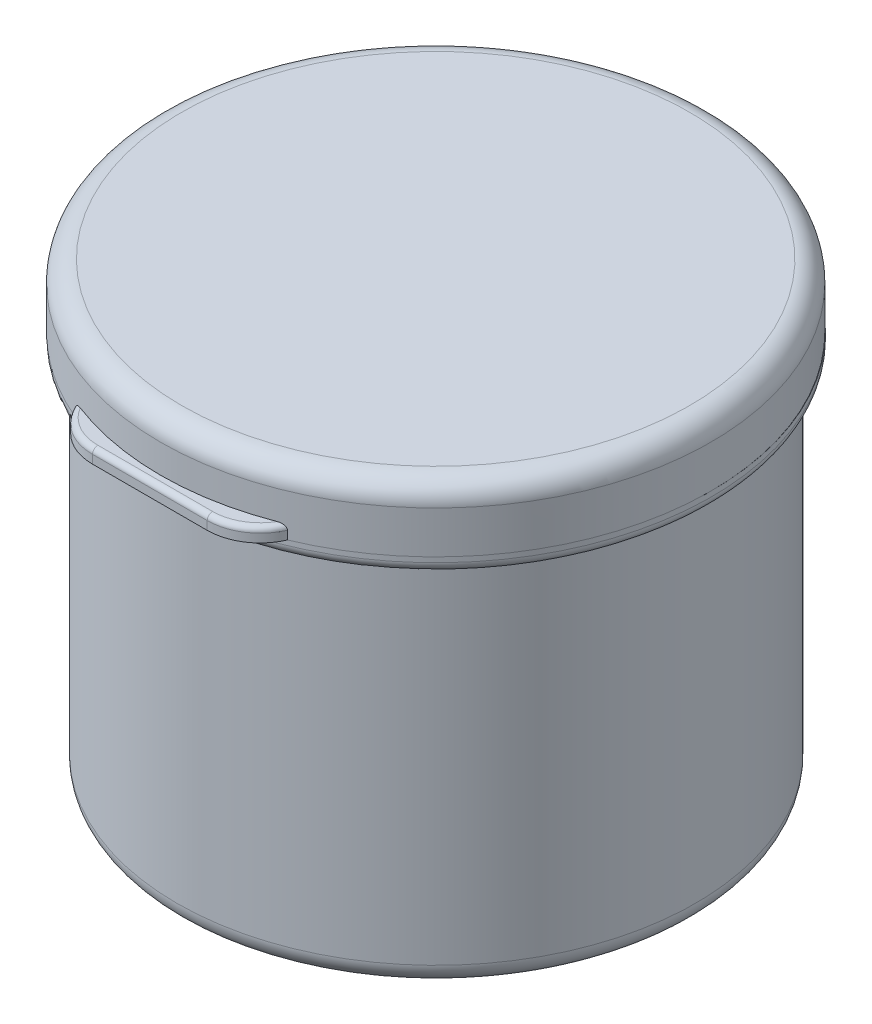
ISO-10303-21;
HEADER;
FILE_DESCRIPTION(('STEP AP214'),'2;1');
FILE_NAME('part.step','',(''),(''),'','','');
FILE_SCHEMA(('AUTOMOTIVE_DESIGN { 1 0 10303 214 1 1 1 1 }'));
ENDSEC;
DATA;
#1=APPLICATION_CONTEXT('core data for automotive mechanical design processes');
#2=APPLICATION_PROTOCOL_DEFINITION('international standard','automotive_design',2000,#1);
#3=PRODUCT_CONTEXT('',#1,'mechanical');
#4=PRODUCT('Part','Part','',(#3));
#5=PRODUCT_RELATED_PRODUCT_CATEGORY('part','',(#4));
#6=PRODUCT_DEFINITION_FORMATION('','',#4);
#7=PRODUCT_DEFINITION_CONTEXT('part definition',#1,'design');
#8=PRODUCT_DEFINITION('design','',#6,#7);
#9=PRODUCT_DEFINITION_SHAPE('','',#8);
#10=(LENGTH_UNIT() NAMED_UNIT(*) SI_UNIT(.MILLI.,.METRE.));
#11=(NAMED_UNIT(*) PLANE_ANGLE_UNIT() SI_UNIT($,.RADIAN.));
#12=(NAMED_UNIT(*) SI_UNIT($,.STERADIAN.) SOLID_ANGLE_UNIT());
#13=UNCERTAINTY_MEASURE_WITH_UNIT(LENGTH_MEASURE(1.E-05),#10,'distance_accuracy_value','');
#14=(GEOMETRIC_REPRESENTATION_CONTEXT(3) GLOBAL_UNCERTAINTY_ASSIGNED_CONTEXT((#13)) GLOBAL_UNIT_ASSIGNED_CONTEXT((#10,
#11,#12)) REPRESENTATION_CONTEXT('',''));
#15=CARTESIAN_POINT('',(0.,0.,0.));
#16=DIRECTION('',(0.,0.,1.));
#17=DIRECTION('',(1.,0.,0.));
#18=AXIS2_PLACEMENT_3D('',#15,#16,#17);
#19=CARTESIAN_POINT('',(0.,36.5,0.));
#20=DIRECTION('',(0.,1.,0.));
#21=DIRECTION('',(0.,0.,1.));
#22=AXIS2_PLACEMENT_3D('',#19,#20,#21);
#23=PLANE('',#22);
#24=CARTESIAN_POINT('',(0.,36.5,0.));
#25=DIRECTION('',(0.,1.,0.));
#26=DIRECTION('',(0.,0.,1.));
#27=AXIS2_PLACEMENT_3D('',#24,#25,#26);
#28=CIRCLE('',#27,26.);
#29=CARTESIAN_POINT('',(0.,36.5,26.));
#30=VERTEX_POINT('',#29);
#31=EDGE_CURVE('P0_E53',#30,#30,#28,.T.);
#32=ORIENTED_EDGE('',*,*,#31,.T.);
#33=EDGE_LOOP('',(#32));
#34=FACE_BOUND('',#33,.T.);
#35=CARTESIAN_POINT('',(0.,36.5,0.));
#36=DIRECTION('',(0.,1.,0.));
#37=DIRECTION('',(0.,0.,1.));
#38=AXIS2_PLACEMENT_3D('',#35,#36,#37);
#39=CIRCLE('',#38,24.5);
#40=CARTESIAN_POINT('',(0.,36.5,24.5));
#41=VERTEX_POINT('',#40);
#42=EDGE_CURVE('P0_E57',#41,#41,#39,.T.);
#43=ORIENTED_EDGE('',*,*,#42,.F.);
#44=EDGE_LOOP('',(#43));
#45=FACE_BOUND('',#44,.T.);
#46=ADVANCED_FACE('P0_F17',(#34,#45),#23,.T.);
#47=CARTESIAN_POINT('',(0.,35.,0.));
#48=DIRECTION('',(0.,1.,0.));
#49=DIRECTION('',(0.,0.,1.));
#50=AXIS2_PLACEMENT_3D('',#47,#48,#49);
#51=CYLINDRICAL_SURFACE('',#50,26.);
#52=CARTESIAN_POINT('',(0.,36.,0.));
#53=DIRECTION('',(0.,1.,0.));
#54=DIRECTION('',(0.,0.,1.));
#55=AXIS2_PLACEMENT_3D('',#52,#53,#54);
#56=CIRCLE('',#55,26.);
#57=CARTESIAN_POINT('',(0.,36.,26.));
#58=VERTEX_POINT('',#57);
#59=EDGE_CURVE('P0_E40',#58,#58,#56,.T.);
#60=ORIENTED_EDGE('',*,*,#59,.T.);
#61=EDGE_LOOP('',(#60));
#62=FACE_BOUND('',#61,.T.);
#63=ORIENTED_EDGE('',*,*,#31,.F.);
#64=EDGE_LOOP('',(#63));
#65=FACE_BOUND('',#64,.T.);
#66=ADVANCED_FACE('P0_F92',(#62,#65),#51,.T.);
#67=CARTESIAN_POINT('',(0.,35.,0.));
#68=DIRECTION('',(0.,1.,0.));
#69=DIRECTION('',(0.,0.,1.));
#70=AXIS2_PLACEMENT_3D('',#67,#68,#69);
#71=PLANE('',#70);
#72=CARTESIAN_POINT('',(0.,35.,0.));
#73=DIRECTION('',(0.,1.,0.));
#74=DIRECTION('',(0.,0.,1.));
#75=AXIS2_PLACEMENT_3D('',#72,#73,#74);
#76=CIRCLE('',#75,25.);
#77=CARTESIAN_POINT('',(0.,35.,25.));
#78=VERTEX_POINT('',#77);
#79=EDGE_CURVE('P0_E37',#78,#78,#76,.F.);
#80=ORIENTED_EDGE('',*,*,#79,.T.);
#81=EDGE_LOOP('',(#80));
#82=FACE_BOUND('',#81,.T.);
#83=CARTESIAN_POINT('',(0.,35.,0.));
#84=DIRECTION('',(0.,1.,0.));
#85=DIRECTION('',(0.,0.,1.));
#86=AXIS2_PLACEMENT_3D('',#83,#84,#85);
#87=CIRCLE('',#86,24.5);
#88=CARTESIAN_POINT('',(0.,35.,24.5));
#89=VERTEX_POINT('',#88);
#90=EDGE_CURVE('P0_E50',#89,#89,#87,.T.);
#91=ORIENTED_EDGE('',*,*,#90,.T.);
#92=EDGE_LOOP('',(#91));
#93=FACE_BOUND('',#92,.T.);
#94=ADVANCED_FACE('P0_F98',(#82,#93),#71,.F.);
#95=CARTESIAN_POINT('',(0.,0.,0.));
#96=DIRECTION('',(0.,1.,0.));
#97=DIRECTION('',(0.,0.,1.));
#98=AXIS2_PLACEMENT_3D('',#95,#96,#97);
#99=PLANE('',#98);
#100=CARTESIAN_POINT('',(0.,0.,0.));
#101=DIRECTION('',(0.,1.,0.));
#102=DIRECTION('',(0.,0.,1.));
#103=AXIS2_PLACEMENT_3D('',#100,#101,#102);
#104=CIRCLE('',#103,22.5);
#105=CARTESIAN_POINT('',(0.,0.,22.5));
#106=VERTEX_POINT('',#105);
#107=EDGE_CURVE('P0_E28',#106,#106,#104,.F.);
#108=ORIENTED_EDGE('',*,*,#107,.T.);
#109=EDGE_LOOP('',(#108));
#110=FACE_BOUND('',#109,.T.);
#111=ADVANCED_FACE('P0_F105',(#110),#99,.F.);
#112=CARTESIAN_POINT('',(0.,36.5,0.));
#113=DIRECTION('',(0.,-1.,0.));
#114=DIRECTION('',(0.,0.,-1.));
#115=AXIS2_PLACEMENT_3D('',#112,#113,#114);
#116=CYLINDRICAL_SURFACE('',#115,24.5);
#117=CARTESIAN_POINT('',(0.,2.,0.));
#118=DIRECTION('',(0.,1.,0.));
#119=DIRECTION('',(0.,0.,1.));
#120=AXIS2_PLACEMENT_3D('',#117,#118,#119);
#121=CIRCLE('',#120,24.5);
#122=CARTESIAN_POINT('',(0.,2.,24.5));
#123=VERTEX_POINT('',#122);
#124=EDGE_CURVE('P0_E32',#123,#123,#121,.T.);
#125=ORIENTED_EDGE('',*,*,#124,.T.);
#126=EDGE_LOOP('',(#125));
#127=FACE_BOUND('',#126,.T.);
#128=ORIENTED_EDGE('',*,*,#90,.F.);
#129=EDGE_LOOP('',(#128));
#130=FACE_BOUND('',#129,.T.);
#131=ADVANCED_FACE('P0_F108',(#127,#130),#116,.T.);
#132=CARTESIAN_POINT('',(0.,39.4,0.));
#133=DIRECTION('',(0.,-1.,0.));
#134=DIRECTION('',(0.,0.,-1.));
#135=AXIS2_PLACEMENT_3D('',#132,#133,#134);
#136=CYLINDRICAL_SURFACE('',#135,24.5);
#137=CARTESIAN_POINT('',(0.,39.4,0.));
#138=DIRECTION('',(0.,1.,0.));
#139=DIRECTION('',(0.,0.,1.));
#140=AXIS2_PLACEMENT_3D('',#137,#138,#139);
#141=CIRCLE('',#140,24.5);
#142=CARTESIAN_POINT('',(0.,39.4,24.5));
#143=VERTEX_POINT('',#142);
#144=EDGE_CURVE('P0_E56',#143,#143,#141,.T.);
#145=ORIENTED_EDGE('',*,*,#144,.F.);
#146=EDGE_LOOP('',(#145));
#147=FACE_BOUND('',#146,.T.);
#148=ORIENTED_EDGE('',*,*,#42,.T.);
#149=EDGE_LOOP('',(#148));
#150=FACE_BOUND('',#149,.T.);
#151=ADVANCED_FACE('P0_F112',(#147,#150),#136,.T.);
#152=CARTESIAN_POINT('',(0.,40.4,0.));
#153=DIRECTION('',(0.,1.,0.));
#154=DIRECTION('',(0.,0.,1.));
#155=AXIS2_PLACEMENT_3D('',#152,#153,#154);
#156=PLANE('',#155);
#157=CARTESIAN_POINT('',(0.,40.4,0.));
#158=DIRECTION('',(0.,1.,0.));
#159=DIRECTION('',(0.,0.,1.));
#160=AXIS2_PLACEMENT_3D('',#157,#158,#159);
#161=CIRCLE('',#160,24.445);
#162=CARTESIAN_POINT('',(0.,40.4,24.445));
#163=VERTEX_POINT('',#162);
#164=EDGE_CURVE('P0_E49',#163,#163,#161,.T.);
#165=ORIENTED_EDGE('',*,*,#164,.F.);
#166=EDGE_LOOP('',(#165));
#167=FACE_BOUND('',#166,.T.);
#168=CARTESIAN_POINT('',(0.,40.4,0.));
#169=DIRECTION('',(0.,1.,0.));
#170=DIRECTION('',(0.,0.,1.));
#171=AXIS2_PLACEMENT_3D('',#168,#169,#170);
#172=CIRCLE('',#171,24.55);
#173=CARTESIAN_POINT('',(0.,40.4,24.55));
#174=VERTEX_POINT('',#173);
#175=EDGE_CURVE('P0_E60',#174,#174,#172,.T.);
#176=ORIENTED_EDGE('',*,*,#175,.T.);
#177=EDGE_LOOP('',(#176));
#178=FACE_BOUND('',#177,.T.);
#179=ADVANCED_FACE('P0_F182',(#167,#178),#156,.T.);
#180=CARTESIAN_POINT('',(0.,39.4,0.));
#181=DIRECTION('',(0.,1.,0.));
#182=DIRECTION('',(0.,0.,1.));
#183=AXIS2_PLACEMENT_3D('',#180,#181,#182);
#184=PLANE('',#183);
#185=ORIENTED_EDGE('',*,*,#144,.T.);
#186=EDGE_LOOP('',(#185));
#187=FACE_BOUND('',#186,.T.);
#188=CARTESIAN_POINT('',(0.,39.4,0.));
#189=DIRECTION('',(0.,1.,0.));
#190=DIRECTION('',(0.,0.,1.));
#191=AXIS2_PLACEMENT_3D('',#188,#189,#190);
#192=CIRCLE('',#191,24.55);
#193=CARTESIAN_POINT('',(0.,39.4,24.55));
#194=VERTEX_POINT('',#193);
#195=EDGE_CURVE('P0_E63',#194,#194,#192,.T.);
#196=ORIENTED_EDGE('',*,*,#195,.F.);
#197=EDGE_LOOP('',(#196));
#198=FACE_BOUND('',#197,.T.);
#199=ADVANCED_FACE('P0_F88',(#187,#198),#184,.F.);
#200=CARTESIAN_POINT('',(0.,40.4,0.));
#201=DIRECTION('',(0.,-1.,0.));
#202=DIRECTION('',(0.,0.,-1.));
#203=AXIS2_PLACEMENT_3D('',#200,#201,#202);
#204=CYLINDRICAL_SURFACE('',#203,24.55);
#205=ORIENTED_EDGE('',*,*,#175,.F.);
#206=EDGE_LOOP('',(#205));
#207=FACE_BOUND('',#206,.T.);
#208=ORIENTED_EDGE('',*,*,#195,.T.);
#209=EDGE_LOOP('',(#208));
#210=FACE_BOUND('',#209,.T.);
#211=ADVANCED_FACE('P0_F79',(#207,#210),#204,.T.);
#212=CARTESIAN_POINT('',(0.,41.4,0.));
#213=DIRECTION('',(0.,1.,0.));
#214=DIRECTION('',(0.,0.,1.));
#215=AXIS2_PLACEMENT_3D('',#212,#213,#214);
#216=PLANE('',#215);
#217=CARTESIAN_POINT('',(0.,41.4,0.));
#218=DIRECTION('',(0.,1.,0.));
#219=DIRECTION('',(0.,0.,1.));
#220=AXIS2_PLACEMENT_3D('',#217,#218,#219);
#221=CIRCLE('',#220,23.945);
#222=CARTESIAN_POINT('',(0.,41.4,23.945));
#223=VERTEX_POINT('',#222);
#224=EDGE_CURVE('P0_E24',#223,#223,#221,.T.);
#225=ORIENTED_EDGE('',*,*,#224,.T.);
#226=EDGE_LOOP('',(#225));
#227=FACE_BOUND('',#226,.T.);
#228=CARTESIAN_POINT('',(0.,41.4,0.));
#229=DIRECTION('',(0.,1.,0.));
#230=DIRECTION('',(0.,0.,1.));
#231=AXIS2_PLACEMENT_3D('',#228,#229,#230);
#232=CIRCLE('',#231,23.5);
#233=CARTESIAN_POINT('',(0.,41.4,23.5));
#234=VERTEX_POINT('',#233);
#235=EDGE_CURVE('P0_E66',#234,#234,#232,.T.);
#236=ORIENTED_EDGE('',*,*,#235,.F.);
#237=EDGE_LOOP('',(#236));
#238=FACE_BOUND('',#237,.T.);
#239=ADVANCED_FACE('P0_F76',(#227,#238),#216,.T.);
#240=CARTESIAN_POINT('',(0.,41.4,0.));
#241=DIRECTION('',(0.,-1.,0.));
#242=DIRECTION('',(0.,0.,-1.));
#243=AXIS2_PLACEMENT_3D('',#240,#241,#242);
#244=CYLINDRICAL_SURFACE('',#243,24.445);
#245=CARTESIAN_POINT('',(0.,40.9,0.));
#246=DIRECTION('',(0.,1.,0.));
#247=DIRECTION('',(0.,0.,1.));
#248=AXIS2_PLACEMENT_3D('',#245,#246,#247);
#249=CIRCLE('',#248,24.445);
#250=CARTESIAN_POINT('',(0.,40.9,24.445));
#251=VERTEX_POINT('',#250);
#252=EDGE_CURVE('P0_E11',#251,#251,#249,.F.);
#253=ORIENTED_EDGE('',*,*,#252,.T.);
#254=EDGE_LOOP('',(#253));
#255=FACE_BOUND('',#254,.T.);
#256=ORIENTED_EDGE('',*,*,#164,.T.);
#257=EDGE_LOOP('',(#256));
#258=FACE_BOUND('',#257,.T.);
#259=ADVANCED_FACE('P0_F78',(#255,#258),#244,.T.);
#260=CARTESIAN_POINT('',(0.,1.,0.));
#261=DIRECTION('',(0.,1.,0.));
#262=DIRECTION('',(0.,0.,1.));
#263=AXIS2_PLACEMENT_3D('',#260,#261,#262);
#264=PLANE('',#263);
#265=CARTESIAN_POINT('',(0.,1.,0.));
#266=DIRECTION('',(0.,1.,0.));
#267=DIRECTION('',(0.,0.,1.));
#268=AXIS2_PLACEMENT_3D('',#265,#266,#267);
#269=CIRCLE('',#268,22.5);
#270=CARTESIAN_POINT('',(0.,1.,22.5));
#271=VERTEX_POINT('',#270);
#272=EDGE_CURVE('P0_E46',#271,#271,#269,.T.);
#273=ORIENTED_EDGE('',*,*,#272,.T.);
#274=EDGE_LOOP('',(#273));
#275=FACE_BOUND('',#274,.T.);
#276=ADVANCED_FACE('P0_F86',(#275),#264,.T.);
#277=CARTESIAN_POINT('',(0.,36.5,0.));
#278=DIRECTION('',(0.,-1.,0.));
#279=DIRECTION('',(0.,0.,-1.));
#280=AXIS2_PLACEMENT_3D('',#277,#278,#279);
#281=CYLINDRICAL_SURFACE('',#280,23.5);
#282=CARTESIAN_POINT('',(0.,2.,0.));
#283=DIRECTION('',(0.,1.,0.));
#284=DIRECTION('',(0.,0.,1.));
#285=AXIS2_PLACEMENT_3D('',#282,#283,#284);
#286=CIRCLE('',#285,23.5);
#287=CARTESIAN_POINT('',(0.,2.,23.5));
#288=VERTEX_POINT('',#287);
#289=EDGE_CURVE('P0_E43',#288,#288,#286,.F.);
#290=ORIENTED_EDGE('',*,*,#289,.T.);
#291=EDGE_LOOP('',(#290));
#292=FACE_BOUND('',#291,.T.);
#293=ORIENTED_EDGE('',*,*,#235,.T.);
#294=EDGE_LOOP('',(#293));
#295=FACE_BOUND('',#294,.T.);
#296=ADVANCED_FACE('P0_F74',(#292,#295),#281,.F.);
#297=CARTESIAN_POINT('',(0.,2.,0.));
#298=DIRECTION('',(0.,1.,0.));
#299=DIRECTION('',(0.,0.,1.));
#300=AXIS2_PLACEMENT_3D('',#297,#298,#299);
#301=TOROIDAL_SURFACE('',#300,22.5,1.);
#302=ORIENTED_EDGE('',*,*,#289,.F.);
#303=EDGE_LOOP('',(#302));
#304=FACE_BOUND('',#303,.T.);
#305=ORIENTED_EDGE('',*,*,#272,.F.);
#306=EDGE_LOOP('',(#305));
#307=FACE_BOUND('',#306,.T.);
#308=ADVANCED_FACE('P0_F114',(#304,#307),#301,.F.);
#309=CARTESIAN_POINT('',(0.,36.,0.));
#310=DIRECTION('',(0.,1.,0.));
#311=DIRECTION('',(0.,0.,1.));
#312=AXIS2_PLACEMENT_3D('',#309,#310,#311);
#313=TOROIDAL_SURFACE('',#312,25.,1.);
#314=ORIENTED_EDGE('',*,*,#79,.F.);
#315=EDGE_LOOP('',(#314));
#316=FACE_BOUND('',#315,.T.);
#317=ORIENTED_EDGE('',*,*,#59,.F.);
#318=EDGE_LOOP('',(#317));
#319=FACE_BOUND('',#318,.T.);
#320=ADVANCED_FACE('P0_F117',(#316,#319),#313,.T.);
#321=CARTESIAN_POINT('',(0.,2.,0.));
#322=DIRECTION('',(0.,1.,0.));
#323=DIRECTION('',(0.,0.,1.));
#324=AXIS2_PLACEMENT_3D('',#321,#322,#323);
#325=TOROIDAL_SURFACE('',#324,22.5,2.);
#326=ORIENTED_EDGE('',*,*,#107,.F.);
#327=EDGE_LOOP('',(#326));
#328=FACE_BOUND('',#327,.T.);
#329=ORIENTED_EDGE('',*,*,#124,.F.);
#330=EDGE_LOOP('',(#329));
#331=FACE_BOUND('',#330,.T.);
#332=ADVANCED_FACE('P0_F120',(#328,#331),#325,.T.);
#333=CARTESIAN_POINT('',(0.,40.9,0.));
#334=DIRECTION('',(0.,1.,0.));
#335=DIRECTION('',(0.,0.,1.));
#336=AXIS2_PLACEMENT_3D('',#333,#334,#335);
#337=TOROIDAL_SURFACE('',#336,23.945,0.5);
#338=ORIENTED_EDGE('',*,*,#252,.F.);
#339=EDGE_LOOP('',(#338));
#340=FACE_BOUND('',#339,.T.);
#341=ORIENTED_EDGE('',*,*,#224,.F.);
#342=EDGE_LOOP('',(#341));
#343=FACE_BOUND('',#342,.T.);
#344=ADVANCED_FACE('P0_F19',(#340,#343),#337,.T.);
#345=CLOSED_SHELL('',(#46,#66,#94,#111,#131,#151,#179,#199,#211,#239,#259,#276,#296,#308,#320,
#332,#344));
#346=MANIFOLD_SOLID_BREP('P0_B1',#345);
#347=CARTESIAN_POINT('',(5.,35.8649147038914,-25.45));
#348=DIRECTION('',(0.,0.,-1.));
#349=DIRECTION('',(-1.,0.,0.));
#350=AXIS2_PLACEMENT_3D('',#347,#348,#349);
#351=PLANE('',#350);
#352=DIRECTION('',(0.,-1.,0.));
#353=VECTOR('',#352,1.);
#354=CARTESIAN_POINT('',(-5.,35.8649147038914,-25.45));
#355=LINE('',#354,#353);
#356=CARTESIAN_POINT('',(-5.,36.5,-25.45));
#357=VERTEX_POINT('',#356);
#358=CARTESIAN_POINT('',(-5.,35.8649147038914,-25.45));
#359=VERTEX_POINT('',#358);
#360=EDGE_CURVE('P1_E64',#357,#359,#355,.T.);
#361=ORIENTED_EDGE('',*,*,#360,.T.);
#362=DIRECTION('',(-1.,0.,0.));
#363=VECTOR('',#362,1.);
#364=CARTESIAN_POINT('',(5.,35.8649147038914,-25.45));
#365=LINE('',#364,#363);
#366=CARTESIAN_POINT('',(5.,35.8649147038914,-25.45));
#367=VERTEX_POINT('',#366);
#368=EDGE_CURVE('P1_E11',#367,#359,#365,.T.);
#369=ORIENTED_EDGE('',*,*,#368,.F.);
#370=DIRECTION('',(0.,-1.,0.));
#371=VECTOR('',#370,1.);
#372=CARTESIAN_POINT('',(5.,35.8649147038914,-25.45));
#373=LINE('',#372,#371);
#374=CARTESIAN_POINT('',(5.,36.5,-25.45));
#375=VERTEX_POINT('',#374);
#376=EDGE_CURVE('P1_E57',#375,#367,#373,.T.);
#377=ORIENTED_EDGE('',*,*,#376,.F.);
#378=DIRECTION('',(-1.,0.,0.));
#379=VECTOR('',#378,1.);
#380=CARTESIAN_POINT('',(5.,36.5,-25.45));
#381=LINE('',#380,#379);
#382=EDGE_CURVE('P1_E65',#375,#357,#381,.T.);
#383=ORIENTED_EDGE('',*,*,#382,.T.);
#384=EDGE_LOOP('',(#361,#369,#377,#383));
#385=FACE_BOUND('',#384,.T.);
#386=ADVANCED_FACE('P1_F17',(#385),#351,.F.);
#387=CARTESIAN_POINT('',(5.,36.5,-26.55));
#388=DIRECTION('',(0.,0.866025403784441,0.499999999999997));
#389=DIRECTION('',(0.,-0.499999999999997,0.866025403784441));
#390=AXIS2_PLACEMENT_3D('',#387,#388,#389);
#391=PLANE('',#390);
#392=DIRECTION('',(0.,0.499999999999997,-0.866025403784441));
#393=VECTOR('',#392,1.);
#394=CARTESIAN_POINT('',(-5.,36.5,-26.55));
#395=LINE('',#394,#393);
#396=CARTESIAN_POINT('',(-5.,36.5,-26.55));
#397=VERTEX_POINT('',#396);
#398=EDGE_CURVE('P1_E45',#359,#397,#395,.T.);
#399=ORIENTED_EDGE('',*,*,#398,.T.);
#400=DIRECTION('',(-1.,0.,0.));
#401=VECTOR('',#400,1.);
#402=CARTESIAN_POINT('',(5.,36.5,-26.55));
#403=LINE('',#402,#401);
#404=CARTESIAN_POINT('',(5.,36.5,-26.55));
#405=VERTEX_POINT('',#404);
#406=EDGE_CURVE('P1_E25',#405,#397,#403,.T.);
#407=ORIENTED_EDGE('',*,*,#406,.F.);
#408=DIRECTION('',(0.,0.499999999999997,-0.866025403784441));
#409=VECTOR('',#408,1.);
#410=CARTESIAN_POINT('',(5.,36.5,-26.55));
#411=LINE('',#410,#409);
#412=EDGE_CURVE('P1_E53',#367,#405,#411,.T.);
#413=ORIENTED_EDGE('',*,*,#412,.F.);
#414=ORIENTED_EDGE('',*,*,#368,.T.);
#415=EDGE_LOOP('',(#399,#407,#413,#414));
#416=FACE_BOUND('',#415,.T.);
#417=ADVANCED_FACE('P1_F54',(#416),#391,.F.);
#418=CARTESIAN_POINT('',(5.,36.5,-25.45));
#419=DIRECTION('',(0.,-1.,0.));
#420=DIRECTION('',(0.,0.,-1.));
#421=AXIS2_PLACEMENT_3D('',#418,#419,#420);
#422=PLANE('',#421);
#423=DIRECTION('',(0.,0.,1.));
#424=VECTOR('',#423,1.);
#425=CARTESIAN_POINT('',(-5.,36.5,-25.45));
#426=LINE('',#425,#424);
#427=EDGE_CURVE('P1_E50',#397,#357,#426,.T.);
#428=ORIENTED_EDGE('',*,*,#427,.T.);
#429=ORIENTED_EDGE('',*,*,#382,.F.);
#430=DIRECTION('',(0.,0.,1.));
#431=VECTOR('',#430,1.);
#432=CARTESIAN_POINT('',(5.,36.5,-25.45));
#433=LINE('',#432,#431);
#434=EDGE_CURVE('P1_E33',#405,#375,#433,.T.);
#435=ORIENTED_EDGE('',*,*,#434,.F.);
#436=ORIENTED_EDGE('',*,*,#406,.T.);
#437=EDGE_LOOP('',(#428,#429,#435,#436));
#438=FACE_BOUND('',#437,.T.);
#439=ADVANCED_FACE('P1_F72',(#438),#422,.F.);
#440=CARTESIAN_POINT('',(5.,0.,0.));
#441=DIRECTION('',(-1.,0.,0.));
#442=DIRECTION('',(0.,0.,1.));
#443=AXIS2_PLACEMENT_3D('',#440,#441,#442);
#444=PLANE('',#443);
#445=ORIENTED_EDGE('',*,*,#376,.T.);
#446=ORIENTED_EDGE('',*,*,#412,.T.);
#447=ORIENTED_EDGE('',*,*,#434,.T.);
#448=EDGE_LOOP('',(#445,#446,#447));
#449=FACE_BOUND('',#448,.T.);
#450=ADVANCED_FACE('P1_F60',(#449),#444,.F.);
#451=CARTESIAN_POINT('',(-5.,0.,0.));
#452=DIRECTION('',(-1.,0.,0.));
#453=DIRECTION('',(0.,0.,1.));
#454=AXIS2_PLACEMENT_3D('',#451,#452,#453);
#455=PLANE('',#454);
#456=ORIENTED_EDGE('',*,*,#360,.F.);
#457=ORIENTED_EDGE('',*,*,#427,.F.);
#458=ORIENTED_EDGE('',*,*,#398,.F.);
#459=EDGE_LOOP('',(#456,#457,#458));
#460=FACE_BOUND('',#459,.T.);
#461=ADVANCED_FACE('P1_F73',(#460),#455,.T.);
#462=CLOSED_SHELL('',(#386,#417,#439,#450,#461));
#463=MANIFOLD_SOLID_BREP('P1_B1',#462);
#464=CARTESIAN_POINT('',(0.,42.5,0.0500000000000084));
#465=DIRECTION('',(0.,-1.,0.));
#466=DIRECTION('',(0.,0.,-1.));
#467=AXIS2_PLACEMENT_3D('',#464,#465,#466);
#468=CYLINDRICAL_SURFACE('',#467,26.);
#469=CARTESIAN_POINT('',(0.,40.5,0.0500000000000084));
#470=DIRECTION('',(0.,1.,0.));
#471=DIRECTION('',(0.,0.,1.));
#472=AXIS2_PLACEMENT_3D('',#469,#470,#471);
#473=CIRCLE('',#472,26.);
#474=CARTESIAN_POINT('',(0.,40.5,26.05));
#475=VERTEX_POINT('',#474);
#476=EDGE_CURVE('P2_E141',#475,#475,#473,.F.);
#477=ORIENTED_EDGE('',*,*,#476,.T.);
#478=EDGE_LOOP('',(#477));
#479=FACE_BOUND('',#478,.T.);
#480=DIRECTION('',(0.,-1.,0.));
#481=VECTOR('',#480,1.);
#482=CARTESIAN_POINT('',(-10.,37.8,24.05));
#483=LINE('',#482,#481);
#484=CARTESIAN_POINT('',(-10.,37.3,24.05));
#485=VERTEX_POINT('',#484);
#486=CARTESIAN_POINT('',(-10.,36.5,24.05));
#487=VERTEX_POINT('',#486);
#488=EDGE_CURVE('P2_E107',#485,#487,#483,.T.);
#489=ORIENTED_EDGE('',*,*,#488,.F.);
#490=CARTESIAN_POINT('',(-10.,37.3,24.05));
#491=CARTESIAN_POINT('',(-10.0000480319688,37.3220225998873,24.0499790487303));
#492=CARTESIAN_POINT('',(-9.99806316763427,37.3439900490849,24.0508070409791));
#493=CARTESIAN_POINT('',(-9.99044496071459,37.3869815150601,24.0539796224998));
#494=CARTESIAN_POINT('',(-9.98484332253715,37.4080120483419,24.0563110326857));
#495=CARTESIAN_POINT('',(-9.97041581133145,37.448644518597,24.0623065330499));
#496=CARTESIAN_POINT('',(-9.96159871918364,37.46825017345,24.0659669936898));
#497=CARTESIAN_POINT('',(-9.94127472955115,37.5057878469628,24.0743871735121));
#498=CARTESIAN_POINT('',(-9.92976179644011,37.5237159819361,24.0791493590175));
#499=CARTESIAN_POINT('',(-9.89943835301859,37.5646377028104,24.091661432378));
#500=CARTESIAN_POINT('',(-9.87956689061052,37.5867137381694,24.0998375829792));
#501=CARTESIAN_POINT('',(-9.83680631137269,37.627136791501,24.1173592157995));
#502=CARTESIAN_POINT('',(-9.81391237729157,37.645477735233,24.1267065634492));
#503=CARTESIAN_POINT('',(-9.7554362530347,37.6859938019207,24.1504739120171));
#504=CARTESIAN_POINT('',(-9.71871911330195,37.7062794733867,24.1653096330683));
#505=CARTESIAN_POINT('',(-9.64267633010492,37.7404589875217,24.1958172352103));
#506=CARTESIAN_POINT('',(-9.60334165140705,37.7543292203734,24.2114919716809));
#507=CARTESIAN_POINT('',(-9.51963365399989,37.7774055112361,24.2446020461625));
#508=CARTESIAN_POINT('',(-9.47512752694268,37.786072346511,24.2620678080536));
#509=CARTESIAN_POINT('',(-9.38583780708842,37.7973157461329,24.2968218389458));
#510=CARTESIAN_POINT('',(-9.34106263576973,37.7999581801544,24.3141099496237));
#511=CARTESIAN_POINT('',(-9.29634151051279,37.8,24.3312280274272));
#512=B_SPLINE_CURVE_WITH_KNOTS('',3,(#490,#491,#492,#493,#494,#495,#496,#497,#498,#499,#500,
#501,#502,#503,#504,#505,#506,#507,#508,#509,#510,#511),.UNSPECIFIED.,.F.,.F.,(4,2,2,2,2,2,2,2,
2,2,4),(0.,0.0658755757047333,0.131181389240909,0.196310182586351,0.261586208797714,
0.353493935412139,0.445549955111242,0.578302160372245,0.711539101713852,0.856899185445697,
1.00066214674533),.UNSPECIFIED.);
#513=CARTESIAN_POINT('',(-9.29634151051279,37.8,24.3312280274272));
#514=VERTEX_POINT('',#513);
#515=EDGE_CURVE('P2_E28',#485,#514,#512,.T.);
#516=ORIENTED_EDGE('',*,*,#515,.T.);
#517=CARTESIAN_POINT('',(0.,37.8,0.0500000000000084));
#518=DIRECTION('',(0.,-1.,0.));
#519=DIRECTION('',(0.,0.,-1.));
#520=AXIS2_PLACEMENT_3D('',#517,#518,#519);
#521=CIRCLE('',#520,26.);
#522=CARTESIAN_POINT('',(9.29634151051278,37.8,24.3312280274272));
#523=VERTEX_POINT('',#522);
#524=EDGE_CURVE('P2_E108',#523,#514,#521,.T.);
#525=ORIENTED_EDGE('',*,*,#524,.F.);
#526=CARTESIAN_POINT('',(9.29634151051279,37.8,24.3312280274272));
#527=CARTESIAN_POINT('',(9.32690651467624,37.7999907564044,24.3195265665861));
#528=CARTESIAN_POINT('',(9.35746499234473,37.7987487069315,24.3077600596503));
#529=CARTESIAN_POINT('',(9.41844157487571,37.7935999386165,24.2841499102807));
#530=CARTESIAN_POINT('',(9.44885887145312,37.789684344883,24.2723061414707));
#531=CARTESIAN_POINT('',(9.50962113540749,37.7789156083914,24.2485161983106));
#532=CARTESIAN_POINT('',(9.5399597325369,37.772023999746,24.2365707637109));
#533=CARTESIAN_POINT('',(9.59976814406513,37.7550386693123,24.2128947640028));
#534=CARTESIAN_POINT('',(9.6292392334138,37.7449499324542,24.2011638942644));
#535=CARTESIAN_POINT('',(9.68864762304848,37.7205289789253,24.1773950193262));
#536=CARTESIAN_POINT('',(9.71850616939751,37.7059778515948,24.1653810432457));
#537=CARTESIAN_POINT('',(9.77591702530017,37.6725166173692,24.1421646766838));
#538=CARTESIAN_POINT('',(9.80347737591672,37.6536226597082,24.130959476661));
#539=CARTESIAN_POINT('',(9.84999459665078,37.6153591796696,24.1119638878903));
#540=CARTESIAN_POINT('',(9.86956470969712,37.5968569509439,24.1039409627309));
#541=CARTESIAN_POINT('',(9.90572573511318,37.5566941820476,24.0890719167436));
#542=CARTESIAN_POINT('',(9.92231933390408,37.5350365221044,24.0822247350019));
#543=CARTESIAN_POINT('',(9.94827581461964,37.4938009351707,24.0714895800497));
#544=CARTESIAN_POINT('',(9.95842638801921,37.4748039453779,24.0672819260102));
#545=CARTESIAN_POINT('',(9.97569188256622,37.4352758116935,24.0601157632492));
#546=CARTESIAN_POINT('',(9.98281345290309,37.4147481456417,24.0571545185922));
#547=CARTESIAN_POINT('',(9.99205491594314,37.3784829354507,24.0533092945559));
#548=CARTESIAN_POINT('',(9.99501374576807,37.3629929933598,24.0520771659802));
#549=CARTESIAN_POINT('',(9.99899572313683,37.331674786623,24.050418450248));
#550=CARTESIAN_POINT('',(10.00001261379,37.3158455940005,24.0499944669282));
#551=CARTESIAN_POINT('',(10.,37.3,24.05));
#552=B_SPLINE_CURVE_WITH_KNOTS('',3,(#526,#527,#528,#529,#530,#531,#532,#533,#534,#535,#536,
#537,#538,#539,#540,#541,#542,#543,#544,#545,#546,#547,#548,#549,#550,#551),.UNSPECIFIED.,.F.,
.F.,(4,2,2,2,2,2,2,2,2,2,2,2,4),(0.,0.0981876887091667,0.196702908521703,0.296531479347042,
0.396205158018364,0.501879691079011,0.607167444748941,0.691183429918082,0.775123201586273,
0.840706530160916,0.906145139423705,0.953463235292547,1.00093353361456),.UNSPECIFIED.);
#553=CARTESIAN_POINT('',(10.,37.3,24.05));
#554=VERTEX_POINT('',#553);
#555=EDGE_CURVE('P2_E11',#523,#554,#552,.T.);
#556=ORIENTED_EDGE('',*,*,#555,.T.);
#557=DIRECTION('',(0.,-1.,0.));
#558=VECTOR('',#557,1.);
#559=CARTESIAN_POINT('',(10.,37.8,24.05));
#560=LINE('',#559,#558);
#561=CARTESIAN_POINT('',(10.,36.5,24.05));
#562=VERTEX_POINT('',#561);
#563=EDGE_CURVE('P2_E101',#554,#562,#560,.T.);
#564=ORIENTED_EDGE('',*,*,#563,.T.);
#565=CARTESIAN_POINT('',(0.,36.5,0.0500000000000084));
#566=DIRECTION('',(0.,1.,0.));
#567=DIRECTION('',(0.,0.,1.));
#568=AXIS2_PLACEMENT_3D('',#565,#566,#567);
#569=CIRCLE('',#568,26.);
#570=CARTESIAN_POINT('',(5.,36.5,-25.4647016443461));
#571=VERTEX_POINT('',#570);
#572=EDGE_CURVE('P2_E105',#562,#571,#569,.T.);
#573=ORIENTED_EDGE('',*,*,#572,.T.);
#574=DIRECTION('',(0.,-1.,0.));
#575=VECTOR('',#574,1.);
#576=CARTESIAN_POINT('',(5.,42.5,-25.4647016443461));
#577=LINE('',#576,#575);
#578=CARTESIAN_POINT('',(5.,37.1265972977878,-25.4647016443461));
#579=VERTEX_POINT('',#578);
#580=EDGE_CURVE('P2_E305',#571,#579,#577,.F.);
#581=ORIENTED_EDGE('',*,*,#580,.T.);
#582=CARTESIAN_POINT('',(0.,51.8575171604438,0.0500000000000084));
#583=DIRECTION('',(0.,-0.866025403784442,0.499999999999995));
#584=DIRECTION('',(0.,-0.499999999999995,-0.866025403784442));
#585=AXIS2_PLACEMENT_3D('',#582,#583,#584);
#586=ELLIPSE('',#585,30.0222139978604,26.);
#587=CARTESIAN_POINT('',(-5.,37.1265972977878,-25.4647016443461));
#588=VERTEX_POINT('',#587);
#589=EDGE_CURVE('P2_E299',#588,#579,#586,.T.);
#590=ORIENTED_EDGE('',*,*,#589,.F.);
#591=DIRECTION('',(0.,-1.,0.));
#592=VECTOR('',#591,1.);
#593=CARTESIAN_POINT('',(-5.,42.5,-25.4647016443461));
#594=LINE('',#593,#592);
#595=CARTESIAN_POINT('',(-5.,36.5,-25.4647016443461));
#596=VERTEX_POINT('',#595);
#597=EDGE_CURVE('P2_E302',#596,#588,#594,.F.);
#598=ORIENTED_EDGE('',*,*,#597,.F.);
#599=EDGE_CURVE('P2_E123',#596,#487,#569,.T.);
#600=ORIENTED_EDGE('',*,*,#599,.T.);
#601=EDGE_LOOP('',(#489,#516,#525,#556,#564,#573,#581,#590,#598,#600));
#602=FACE_BOUND('',#601,.T.);
#603=ADVANCED_FACE('P2_F18',(#479,#602),#468,.T.);
#604=CARTESIAN_POINT('',(0.,39.,0.0500000000000084));
#605=DIRECTION('',(0.,-1.,0.));
#606=DIRECTION('',(0.,0.,-1.));
#607=AXIS2_PLACEMENT_3D('',#604,#605,#606);
#608=CYLINDRICAL_SURFACE('',#607,25.15);
#609=CARTESIAN_POINT('',(0.,39.,0.0500000000000084));
#610=DIRECTION('',(0.,-1.,0.));
#611=DIRECTION('',(0.,0.,-1.));
#612=AXIS2_PLACEMENT_3D('',#609,#610,#611);
#613=CIRCLE('',#612,25.15);
#614=CARTESIAN_POINT('',(0.,39.,-25.1));
#615=VERTEX_POINT('',#614);
#616=EDGE_CURVE('P2_E124',#615,#615,#613,.T.);
#617=ORIENTED_EDGE('',*,*,#616,.F.);
#618=EDGE_LOOP('',(#617));
#619=FACE_BOUND('',#618,.T.);
#620=DIRECTION('',(0.,-1.,0.));
#621=VECTOR('',#620,1.);
#622=CARTESIAN_POINT('',(2.74271763038045,39.,-24.95));
#623=LINE('',#622,#621);
#624=CARTESIAN_POINT('',(2.74271763038045,36.5,-24.95));
#625=VERTEX_POINT('',#624);
#626=CARTESIAN_POINT('',(2.74271763038044,37.4237604307034,-24.95));
#627=VERTEX_POINT('',#626);
#628=EDGE_CURVE('P2_E150',#625,#627,#623,.F.);
#629=ORIENTED_EDGE('',*,*,#628,.F.);
#630=CARTESIAN_POINT('',(0.,36.5,0.0500000000000084));
#631=DIRECTION('',(0.,-1.,0.));
#632=DIRECTION('',(0.,0.,-1.));
#633=AXIS2_PLACEMENT_3D('',#630,#631,#632);
#634=CIRCLE('',#633,25.15);
#635=CARTESIAN_POINT('',(-2.74271763038046,36.5,-24.95));
#636=VERTEX_POINT('',#635);
#637=EDGE_CURVE('P2_E129',#625,#636,#634,.T.);
#638=ORIENTED_EDGE('',*,*,#637,.T.);
#639=DIRECTION('',(0.,-1.,0.));
#640=VECTOR('',#639,1.);
#641=CARTESIAN_POINT('',(-2.74271763038046,39.,-24.95));
#642=LINE('',#641,#640);
#643=CARTESIAN_POINT('',(-2.74271763038046,37.4237604307034,-24.95));
#644=VERTEX_POINT('',#643);
#645=EDGE_CURVE('P2_E144',#644,#636,#642,.T.);
#646=ORIENTED_EDGE('',*,*,#645,.F.);
#647=CARTESIAN_POINT('',(0.,51.8575171604438,0.0500000000000084));
#648=DIRECTION('',(0.,-0.866025403784442,0.499999999999995));
#649=DIRECTION('',(0.,-0.499999999999995,-0.866025403784442));
#650=AXIS2_PLACEMENT_3D('',#647,#648,#649);
#651=ELLIPSE('',#650,29.0407185402381,25.15);
#652=EDGE_CURVE('P2_E147',#627,#644,#651,.F.);
#653=ORIENTED_EDGE('',*,*,#652,.F.);
#654=EDGE_LOOP('',(#629,#638,#646,#653));
#655=FACE_BOUND('',#654,.T.);
#656=ADVANCED_FACE('P2_F199',(#619,#655),#608,.F.);
#657=CARTESIAN_POINT('',(0.,42.5,0.0500000000000084));
#658=DIRECTION('',(0.,1.,0.));
#659=DIRECTION('',(0.,0.,1.));
#660=AXIS2_PLACEMENT_3D('',#657,#658,#659);
#661=PLANE('',#660);
#662=CARTESIAN_POINT('',(0.,42.5,0.0500000000000084));
#663=DIRECTION('',(0.,1.,0.));
#664=DIRECTION('',(0.,0.,1.));
#665=AXIS2_PLACEMENT_3D('',#662,#663,#664);
#666=CIRCLE('',#665,24.);
#667=CARTESIAN_POINT('',(0.,42.5,24.05));
#668=VERTEX_POINT('',#667);
#669=EDGE_CURVE('P2_E138',#668,#668,#666,.T.);
#670=ORIENTED_EDGE('',*,*,#669,.T.);
#671=EDGE_LOOP('',(#670));
#672=FACE_BOUND('',#671,.T.);
#673=ADVANCED_FACE('P2_F204',(#672),#661,.T.);
#674=CARTESIAN_POINT('',(0.,36.5,0.0500000000000084));
#675=DIRECTION('',(0.,1.,0.));
#676=DIRECTION('',(0.,0.,1.));
#677=AXIS2_PLACEMENT_3D('',#674,#675,#676);
#678=PLANE('',#677);
#679=ORIENTED_EDGE('',*,*,#637,.F.);
#680=DIRECTION('',(-1.,0.,0.));
#681=VECTOR('',#680,1.);
#682=CARTESIAN_POINT('',(5.,36.5,-24.95));
#683=LINE('',#682,#681);
#684=EDGE_CURVE('P2_E293',#625,#636,#683,.T.);
#685=ORIENTED_EDGE('',*,*,#684,.T.);
#686=EDGE_LOOP('',(#679,#685));
#687=FACE_BOUND('',#686,.T.);
#688=ORIENTED_EDGE('',*,*,#572,.F.);
#689=CARTESIAN_POINT('',(5.41742430504416,36.5,22.05));
#690=DIRECTION('',(0.,1.,0.));
#691=DIRECTION('',(0.,0.,1.));
#692=AXIS2_PLACEMENT_3D('',#689,#690,#691);
#693=CIRCLE('',#692,5.);
#694=CARTESIAN_POINT('',(5.41742430504416,36.5,27.05));
#695=VERTEX_POINT('',#694);
#696=EDGE_CURVE('P2_E110',#562,#695,#693,.F.);
#697=ORIENTED_EDGE('',*,*,#696,.T.);
#698=DIRECTION('',(1.,0.,0.));
#699=VECTOR('',#698,1.);
#700=CARTESIAN_POINT('',(0.,36.5,27.05));
#701=LINE('',#700,#699);
#702=CARTESIAN_POINT('',(-5.41742430504416,36.5,27.05));
#703=VERTEX_POINT('',#702);
#704=EDGE_CURVE('P2_E265',#703,#695,#701,.T.);
#705=ORIENTED_EDGE('',*,*,#704,.F.);
#706=CARTESIAN_POINT('',(-5.41742430504416,36.5,22.05));
#707=DIRECTION('',(0.,1.,0.));
#708=DIRECTION('',(0.,0.,1.));
#709=AXIS2_PLACEMENT_3D('',#706,#707,#708);
#710=CIRCLE('',#709,5.);
#711=EDGE_CURVE('P2_E117',#703,#487,#710,.F.);
#712=ORIENTED_EDGE('',*,*,#711,.T.);
#713=ORIENTED_EDGE('',*,*,#599,.F.);
#714=DIRECTION('',(0.,0.,-1.));
#715=VECTOR('',#714,1.);
#716=CARTESIAN_POINT('',(-5.,36.5,0.0500000000000084));
#717=LINE('',#716,#715);
#718=CARTESIAN_POINT('',(-5.,36.5,-26.55));
#719=VERTEX_POINT('',#718);
#720=EDGE_CURVE('P2_E285',#596,#719,#717,.T.);
#721=ORIENTED_EDGE('',*,*,#720,.T.);
#722=DIRECTION('',(-1.,0.,0.));
#723=VECTOR('',#722,1.);
#724=CARTESIAN_POINT('',(5.,36.5,-26.55));
#725=LINE('',#724,#723);
#726=CARTESIAN_POINT('',(5.,36.5,-26.55));
#727=VERTEX_POINT('',#726);
#728=EDGE_CURVE('P2_E287',#727,#719,#725,.T.);
#729=ORIENTED_EDGE('',*,*,#728,.F.);
#730=DIRECTION('',(0.,0.,-1.));
#731=VECTOR('',#730,1.);
#732=CARTESIAN_POINT('',(5.,36.5,0.0500000000000084));
#733=LINE('',#732,#731);
#734=EDGE_CURVE('P2_E122',#571,#727,#733,.T.);
#735=ORIENTED_EDGE('',*,*,#734,.F.);
#736=EDGE_LOOP('',(#688,#697,#705,#712,#713,#721,#729,#735));
#737=FACE_BOUND('',#736,.T.);
#738=ADVANCED_FACE('P2_F120',(#687,#737),#678,.F.);
#739=CARTESIAN_POINT('',(0.,39.,0.0500000000000084));
#740=DIRECTION('',(0.,-1.,0.));
#741=DIRECTION('',(0.,0.,-1.));
#742=AXIS2_PLACEMENT_3D('',#739,#740,#741);
#743=PLANE('',#742);
#744=CARTESIAN_POINT('',(0.,39.,0.0500000000000084));
#745=DIRECTION('',(0.,-1.,0.));
#746=DIRECTION('',(0.,0.,-1.));
#747=AXIS2_PLACEMENT_3D('',#744,#745,#746);
#748=CIRCLE('',#747,24.9);
#749=CARTESIAN_POINT('',(0.,39.,-24.85));
#750=VERTEX_POINT('',#749);
#751=EDGE_CURVE('P2_E307',#750,#750,#748,.T.);
#752=ORIENTED_EDGE('',*,*,#751,.F.);
#753=EDGE_LOOP('',(#752));
#754=FACE_BOUND('',#753,.T.);
#755=ORIENTED_EDGE('',*,*,#616,.T.);
#756=EDGE_LOOP('',(#755));
#757=FACE_BOUND('',#756,.T.);
#758=ADVANCED_FACE('P2_F222',(#754,#757),#743,.T.);
#759=CARTESIAN_POINT('',(0.,41.4,0.0500000000000084));
#760=DIRECTION('',(0.,1.,0.));
#761=DIRECTION('',(0.,0.,1.));
#762=AXIS2_PLACEMENT_3D('',#759,#760,#761);
#763=PLANE('',#762);
#764=CARTESIAN_POINT('',(0.,41.4,0.0500000000000084));
#765=DIRECTION('',(0.,1.,0.));
#766=DIRECTION('',(0.,0.,1.));
#767=AXIS2_PLACEMENT_3D('',#764,#765,#766);
#768=CIRCLE('',#767,24.4);
#769=CARTESIAN_POINT('',(0.,41.4,24.45));
#770=VERTEX_POINT('',#769);
#771=EDGE_CURVE('P2_E135',#770,#770,#768,.F.);
#772=ORIENTED_EDGE('',*,*,#771,.T.);
#773=EDGE_LOOP('',(#772));
#774=FACE_BOUND('',#773,.T.);
#775=ADVANCED_FACE('P2_F225',(#774),#763,.F.);
#776=CARTESIAN_POINT('',(0.,42.5,0.0500000000000084));
#777=DIRECTION('',(0.,-1.,0.));
#778=DIRECTION('',(0.,0.,-1.));
#779=AXIS2_PLACEMENT_3D('',#776,#777,#778);
#780=CYLINDRICAL_SURFACE('',#779,24.9);
#781=CARTESIAN_POINT('',(0.,40.9,0.0500000000000084));
#782=DIRECTION('',(0.,1.,0.));
#783=DIRECTION('',(0.,0.,1.));
#784=AXIS2_PLACEMENT_3D('',#781,#782,#783);
#785=CIRCLE('',#784,24.9);
#786=CARTESIAN_POINT('',(0.,40.9,24.95));
#787=VERTEX_POINT('',#786);
#788=EDGE_CURVE('P2_E127',#787,#787,#785,.T.);
#789=ORIENTED_EDGE('',*,*,#788,.T.);
#790=EDGE_LOOP('',(#789));
#791=FACE_BOUND('',#790,.T.);
#792=ORIENTED_EDGE('',*,*,#751,.T.);
#793=EDGE_LOOP('',(#792));
#794=FACE_BOUND('',#793,.T.);
#795=ADVANCED_FACE('P2_F228',(#791,#794),#780,.F.);
#796=CARTESIAN_POINT('',(0.,40.9,0.0500000000000084));
#797=DIRECTION('',(0.,1.,0.));
#798=DIRECTION('',(0.,0.,1.));
#799=AXIS2_PLACEMENT_3D('',#796,#797,#798);
#800=TOROIDAL_SURFACE('',#799,24.4,0.5);
#801=ORIENTED_EDGE('',*,*,#771,.F.);
#802=EDGE_LOOP('',(#801));
#803=FACE_BOUND('',#802,.T.);
#804=ORIENTED_EDGE('',*,*,#788,.F.);
#805=EDGE_LOOP('',(#804));
#806=FACE_BOUND('',#805,.T.);
#807=ADVANCED_FACE('P2_F213',(#803,#806),#800,.F.);
#808=CARTESIAN_POINT('',(0.,40.5,0.0500000000000084));
#809=DIRECTION('',(0.,1.,0.));
#810=DIRECTION('',(0.,0.,1.));
#811=AXIS2_PLACEMENT_3D('',#808,#809,#810);
#812=TOROIDAL_SURFACE('',#811,24.,2.);
#813=ORIENTED_EDGE('',*,*,#476,.F.);
#814=EDGE_LOOP('',(#813));
#815=FACE_BOUND('',#814,.T.);
#816=ORIENTED_EDGE('',*,*,#669,.F.);
#817=EDGE_LOOP('',(#816));
#818=FACE_BOUND('',#817,.T.);
#819=ADVANCED_FACE('P2_F209',(#815,#818),#812,.T.);
#820=CARTESIAN_POINT('',(5.,36.5,-24.95));
#821=DIRECTION('',(0.,0.,-1.));
#822=DIRECTION('',(-1.,0.,0.));
#823=AXIS2_PLACEMENT_3D('',#820,#821,#822);
#824=PLANE('',#823);
#825=ORIENTED_EDGE('',*,*,#684,.F.);
#826=ORIENTED_EDGE('',*,*,#628,.T.);
#827=DIRECTION('',(-1.,0.,0.));
#828=VECTOR('',#827,1.);
#829=CARTESIAN_POINT('',(5.,37.4237604307034,-24.95));
#830=LINE('',#829,#828);
#831=EDGE_CURVE('P2_E296',#627,#644,#830,.T.);
#832=ORIENTED_EDGE('',*,*,#831,.T.);
#833=ORIENTED_EDGE('',*,*,#645,.T.);
#834=EDGE_LOOP('',(#825,#826,#832,#833));
#835=FACE_BOUND('',#834,.T.);
#836=ADVANCED_FACE('P2_F212',(#835),#824,.F.);
#837=CARTESIAN_POINT('',(5.,48.018137870333,-6.59999999999985));
#838=DIRECTION('',(0.,-0.866025403784442,0.499999999999995));
#839=DIRECTION('',(0.,-0.499999999999995,-0.866025403784442));
#840=AXIS2_PLACEMENT_3D('',#837,#838,#839);
#841=PLANE('',#840);
#842=ORIENTED_EDGE('',*,*,#831,.F.);
#843=ORIENTED_EDGE('',*,*,#652,.T.);
#844=EDGE_LOOP('',(#842,#843));
#845=FACE_BOUND('',#844,.T.);
#846=ADVANCED_FACE('P2_F242',(#845),#841,.F.);
#847=CARTESIAN_POINT('',(5.,36.5,0.0500000000000084));
#848=DIRECTION('',(1.,0.,0.));
#849=DIRECTION('',(0.,0.,-1.));
#850=AXIS2_PLACEMENT_3D('',#847,#848,#849);
#851=PLANE('',#850);
#852=ORIENTED_EDGE('',*,*,#580,.F.);
#853=ORIENTED_EDGE('',*,*,#734,.T.);
#854=DIRECTION('',(0.,0.499999999999995,0.866025403784442));
#855=VECTOR('',#854,1.);
#856=CARTESIAN_POINT('',(5.,48.018137870333,-6.59999999999985));
#857=LINE('',#856,#855);
#858=EDGE_CURVE('P2_E282',#727,#579,#857,.T.);
#859=ORIENTED_EDGE('',*,*,#858,.T.);
#860=EDGE_LOOP('',(#852,#853,#859));
#861=FACE_BOUND('',#860,.T.);
#862=ADVANCED_FACE('P2_F248',(#861),#851,.T.);
#863=CARTESIAN_POINT('',(-5.,36.5,0.0500000000000084));
#864=DIRECTION('',(1.,0.,0.));
#865=DIRECTION('',(0.,0.,-1.));
#866=AXIS2_PLACEMENT_3D('',#863,#864,#865);
#867=PLANE('',#866);
#868=ORIENTED_EDGE('',*,*,#720,.F.);
#869=ORIENTED_EDGE('',*,*,#597,.T.);
#870=DIRECTION('',(0.,0.499999999999995,0.866025403784442));
#871=VECTOR('',#870,1.);
#872=CARTESIAN_POINT('',(-5.,48.018137870333,-6.59999999999985));
#873=LINE('',#872,#871);
#874=EDGE_CURVE('P2_E280',#719,#588,#873,.T.);
#875=ORIENTED_EDGE('',*,*,#874,.F.);
#876=EDGE_LOOP('',(#868,#869,#875));
#877=FACE_BOUND('',#876,.T.);
#878=ADVANCED_FACE('P2_F240',(#877),#867,.F.);
#879=ORIENTED_EDGE('',*,*,#874,.T.);
#880=ORIENTED_EDGE('',*,*,#589,.T.);
#881=ORIENTED_EDGE('',*,*,#858,.F.);
#882=ORIENTED_EDGE('',*,*,#728,.T.);
#883=EDGE_LOOP('',(#879,#880,#881,#882));
#884=FACE_BOUND('',#883,.T.);
#885=ADVANCED_FACE('P2_F236',(#884),#841,.F.);
#886=CARTESIAN_POINT('',(0.,37.8,27.05));
#887=DIRECTION('',(0.,0.,-1.));
#888=DIRECTION('',(-1.,0.,0.));
#889=AXIS2_PLACEMENT_3D('',#886,#887,#888);
#890=PLANE('',#889);
#891=DIRECTION('',(0.,-1.,0.));
#892=VECTOR('',#891,1.);
#893=CARTESIAN_POINT('',(5.41742430504416,37.8,27.05));
#894=LINE('',#893,#892);
#895=CARTESIAN_POINT('',(5.41742430504416,37.3,27.05));
#896=VERTEX_POINT('',#895);
#897=EDGE_CURVE('P2_E112',#695,#896,#894,.F.);
#898=ORIENTED_EDGE('',*,*,#897,.T.);
#899=DIRECTION('',(1.,0.,0.));
#900=VECTOR('',#899,1.);
#901=CARTESIAN_POINT('',(0.,37.3,27.05));
#902=LINE('',#901,#900);
#903=CARTESIAN_POINT('',(-5.41742430504416,37.3,27.05));
#904=VERTEX_POINT('',#903);
#905=EDGE_CURVE('P2_E167',#896,#904,#902,.F.);
#906=ORIENTED_EDGE('',*,*,#905,.T.);
#907=DIRECTION('',(0.,-1.,0.));
#908=VECTOR('',#907,1.);
#909=CARTESIAN_POINT('',(-5.41742430504416,37.8,27.05));
#910=LINE('',#909,#908);
#911=EDGE_CURVE('P2_E116',#904,#703,#910,.T.);
#912=ORIENTED_EDGE('',*,*,#911,.T.);
#913=ORIENTED_EDGE('',*,*,#704,.T.);
#914=EDGE_LOOP('',(#898,#906,#912,#913));
#915=FACE_BOUND('',#914,.T.);
#916=ADVANCED_FACE('P2_F239',(#915),#890,.F.);
#917=CARTESIAN_POINT('',(0.,37.8,0.0500000000000084));
#918=DIRECTION('',(0.,-1.,0.));
#919=DIRECTION('',(0.,0.,-1.));
#920=AXIS2_PLACEMENT_3D('',#917,#918,#919);
#921=PLANE('',#920);
#922=ORIENTED_EDGE('',*,*,#524,.T.);
#923=CARTESIAN_POINT('',(-5.41742430504416,37.8,22.05));
#924=DIRECTION('',(0.,-1.,0.));
#925=DIRECTION('',(0.,0.,-1.));
#926=AXIS2_PLACEMENT_3D('',#923,#924,#925);
#927=CIRCLE('',#926,4.5);
#928=CARTESIAN_POINT('',(-5.41742430504416,37.8,26.55));
#929=VERTEX_POINT('',#928);
#930=EDGE_CURVE('P2_E161',#514,#929,#927,.F.);
#931=ORIENTED_EDGE('',*,*,#930,.T.);
#932=DIRECTION('',(1.,0.,0.));
#933=VECTOR('',#932,1.);
#934=CARTESIAN_POINT('',(0.,37.8,26.55));
#935=LINE('',#934,#933);
#936=CARTESIAN_POINT('',(5.41742430504416,37.8,26.55));
#937=VERTEX_POINT('',#936);
#938=EDGE_CURVE('P2_E157',#929,#937,#935,.T.);
#939=ORIENTED_EDGE('',*,*,#938,.T.);
#940=CARTESIAN_POINT('',(5.41742430504416,37.8,22.05));
#941=DIRECTION('',(0.,-1.,0.));
#942=DIRECTION('',(0.,0.,-1.));
#943=AXIS2_PLACEMENT_3D('',#940,#941,#942);
#944=CIRCLE('',#943,4.5);
#945=EDGE_CURVE('P2_E159',#937,#523,#944,.F.);
#946=ORIENTED_EDGE('',*,*,#945,.T.);
#947=EDGE_LOOP('',(#922,#931,#939,#946));
#948=FACE_BOUND('',#947,.T.);
#949=ADVANCED_FACE('P2_F255',(#948),#921,.F.);
#950=CARTESIAN_POINT('',(5.41742430504416,42.5,22.05));
#951=DIRECTION('',(0.,-1.,0.));
#952=DIRECTION('',(0.,0.,-1.));
#953=AXIS2_PLACEMENT_3D('',#950,#951,#952);
#954=CYLINDRICAL_SURFACE('',#953,5.);
#955=ORIENTED_EDGE('',*,*,#563,.F.);
#956=CARTESIAN_POINT('',(5.41742430504416,37.3,22.05));
#957=DIRECTION('',(0.,-1.,0.));
#958=DIRECTION('',(0.,0.,-1.));
#959=AXIS2_PLACEMENT_3D('',#956,#957,#958);
#960=CIRCLE('',#959,5.);
#961=EDGE_CURVE('P2_E41',#554,#896,#960,.T.);
#962=ORIENTED_EDGE('',*,*,#961,.T.);
#963=ORIENTED_EDGE('',*,*,#897,.F.);
#964=ORIENTED_EDGE('',*,*,#696,.F.);
#965=EDGE_LOOP('',(#955,#962,#963,#964));
#966=FACE_BOUND('',#965,.T.);
#967=ADVANCED_FACE('P2_F111',(#966),#954,.T.);
#968=CARTESIAN_POINT('',(-5.41742430504416,42.5,22.05));
#969=DIRECTION('',(0.,-1.,0.));
#970=DIRECTION('',(0.,0.,-1.));
#971=AXIS2_PLACEMENT_3D('',#968,#969,#970);
#972=CYLINDRICAL_SURFACE('',#971,5.);
#973=ORIENTED_EDGE('',*,*,#911,.F.);
#974=CARTESIAN_POINT('',(-5.41742430504416,37.3,22.05));
#975=DIRECTION('',(0.,-1.,0.));
#976=DIRECTION('',(0.,0.,-1.));
#977=AXIS2_PLACEMENT_3D('',#974,#975,#976);
#978=CIRCLE('',#977,5.);
#979=EDGE_CURVE('P2_E164',#904,#485,#978,.T.);
#980=ORIENTED_EDGE('',*,*,#979,.T.);
#981=ORIENTED_EDGE('',*,*,#488,.T.);
#982=ORIENTED_EDGE('',*,*,#711,.F.);
#983=EDGE_LOOP('',(#973,#980,#981,#982));
#984=FACE_BOUND('',#983,.T.);
#985=ADVANCED_FACE('P2_F188',(#984),#972,.T.);
#986=CARTESIAN_POINT('',(5.41742430504416,37.3,22.05));
#987=DIRECTION('',(0.,-1.,0.));
#988=DIRECTION('',(0.,0.,-1.));
#989=AXIS2_PLACEMENT_3D('',#986,#987,#988);
#990=TOROIDAL_SURFACE('',#989,4.5,0.5);
#991=ORIENTED_EDGE('',*,*,#555,.F.);
#992=ORIENTED_EDGE('',*,*,#945,.F.);
#993=CARTESIAN_POINT('',(5.41742430504416,37.3,26.55));
#994=DIRECTION('',(-1.,0.,0.));
#995=DIRECTION('',(0.,0.,1.));
#996=AXIS2_PLACEMENT_3D('',#993,#994,#995);
#997=CIRCLE('',#996,0.5);
#998=EDGE_CURVE('P2_E23',#896,#937,#997,.T.);
#999=ORIENTED_EDGE('',*,*,#998,.F.);
#1000=ORIENTED_EDGE('',*,*,#961,.F.);
#1001=EDGE_LOOP('',(#991,#992,#999,#1000));
#1002=FACE_BOUND('',#1001,.T.);
#1003=ADVANCED_FACE('P2_F20',(#1002),#990,.T.);
#1004=CARTESIAN_POINT('',(0.,37.3,26.55));
#1005=DIRECTION('',(1.,0.,0.));
#1006=DIRECTION('',(0.,0.,-1.));
#1007=AXIS2_PLACEMENT_3D('',#1004,#1005,#1006);
#1008=CYLINDRICAL_SURFACE('',#1007,0.5);
#1009=ORIENTED_EDGE('',*,*,#998,.T.);
#1010=ORIENTED_EDGE('',*,*,#938,.F.);
#1011=CARTESIAN_POINT('',(-5.41742430504416,37.3,26.55));
#1012=DIRECTION('',(-1.,0.,0.));
#1013=DIRECTION('',(0.,0.,1.));
#1014=AXIS2_PLACEMENT_3D('',#1011,#1012,#1013);
#1015=CIRCLE('',#1014,0.5);
#1016=EDGE_CURVE('P2_E270',#904,#929,#1015,.T.);
#1017=ORIENTED_EDGE('',*,*,#1016,.F.);
#1018=ORIENTED_EDGE('',*,*,#905,.F.);
#1019=EDGE_LOOP('',(#1009,#1010,#1017,#1018));
#1020=FACE_BOUND('',#1019,.T.);
#1021=ADVANCED_FACE('P2_F186',(#1020),#1008,.T.);
#1022=CARTESIAN_POINT('',(-5.41742430504416,37.3,22.05));
#1023=DIRECTION('',(0.,-1.,0.));
#1024=DIRECTION('',(0.,0.,-1.));
#1025=AXIS2_PLACEMENT_3D('',#1022,#1023,#1024);
#1026=TOROIDAL_SURFACE('',#1025,4.5,0.5);
#1027=ORIENTED_EDGE('',*,*,#515,.F.);
#1028=ORIENTED_EDGE('',*,*,#979,.F.);
#1029=ORIENTED_EDGE('',*,*,#1016,.T.);
#1030=ORIENTED_EDGE('',*,*,#930,.F.);
#1031=EDGE_LOOP('',(#1027,#1028,#1029,#1030));
#1032=FACE_BOUND('',#1031,.T.);
#1033=ADVANCED_FACE('P2_F182',(#1032),#1026,.T.);
#1034=CLOSED_SHELL('',(#603,#656,#673,#738,#758,#775,#795,#807,#819,#836,#846,#862,#878,#885,
#916,#949,#967,#985,#1003,#1021,#1033));
#1035=MANIFOLD_SOLID_BREP('P2_B1',#1034);
#1036=ADVANCED_BREP_SHAPE_REPRESENTATION('',(#18,#346,#463,#1035),#14);
#1037=SHAPE_DEFINITION_REPRESENTATION(#9,#1036);
ENDSEC;
END-ISO-10303-21;
